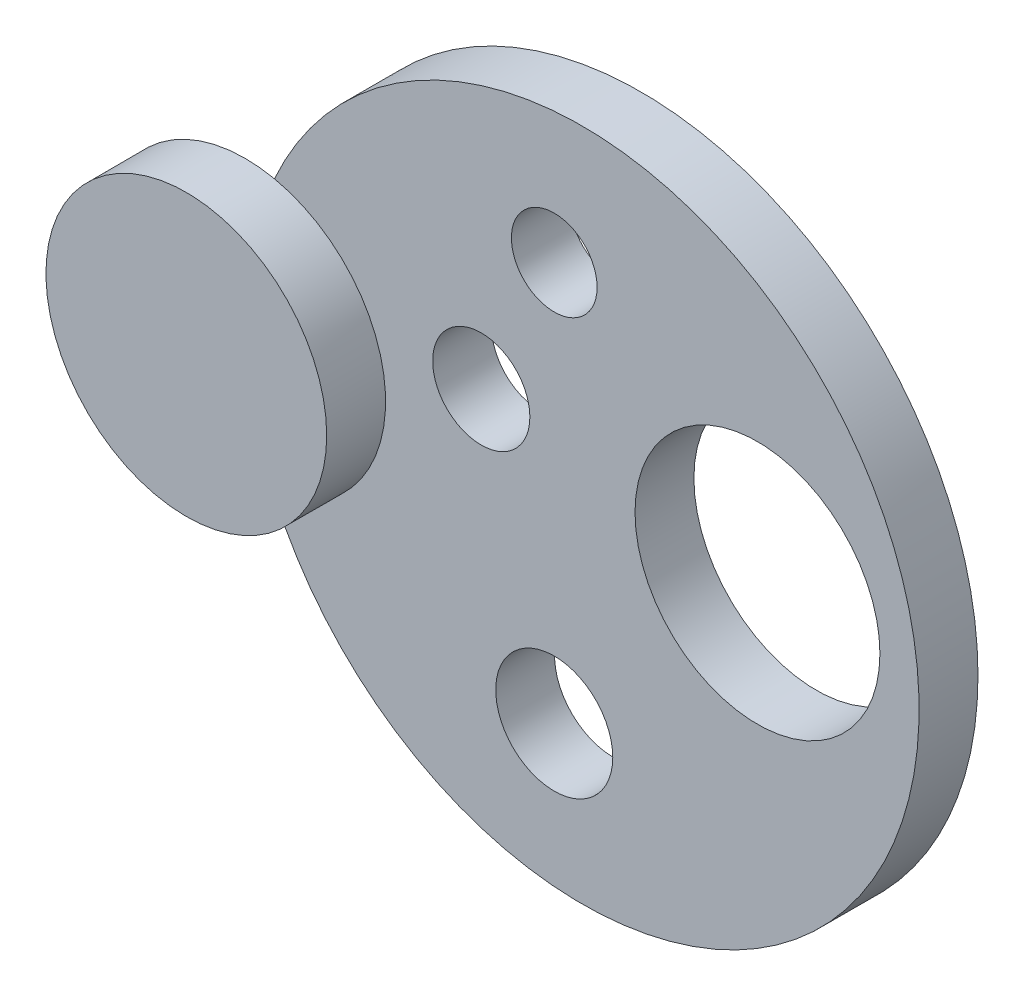
ISO-10303-21;
HEADER;
FILE_DESCRIPTION(('STEP AP214'),'2;1');
FILE_NAME('part.step','',(''),(''),'','','');
FILE_SCHEMA(('AUTOMOTIVE_DESIGN { 1 0 10303 214 1 1 1 1 }'));
ENDSEC;
DATA;
#1=APPLICATION_CONTEXT('core data for automotive mechanical design processes');
#2=APPLICATION_PROTOCOL_DEFINITION('international standard','automotive_design',2000,#1);
#3=PRODUCT_CONTEXT('',#1,'mechanical');
#4=PRODUCT('Part','Part','',(#3));
#5=PRODUCT_RELATED_PRODUCT_CATEGORY('part','',(#4));
#6=PRODUCT_DEFINITION_FORMATION('','',#4);
#7=PRODUCT_DEFINITION_CONTEXT('part definition',#1,'design');
#8=PRODUCT_DEFINITION('design','',#6,#7);
#9=PRODUCT_DEFINITION_SHAPE('','',#8);
#10=(LENGTH_UNIT() NAMED_UNIT(*) SI_UNIT(.MILLI.,.METRE.));
#11=(NAMED_UNIT(*) PLANE_ANGLE_UNIT() SI_UNIT($,.RADIAN.));
#12=(NAMED_UNIT(*) SI_UNIT($,.STERADIAN.) SOLID_ANGLE_UNIT());
#13=UNCERTAINTY_MEASURE_WITH_UNIT(LENGTH_MEASURE(1.E-05),#10,'distance_accuracy_value','');
#14=(GEOMETRIC_REPRESENTATION_CONTEXT(3) GLOBAL_UNCERTAINTY_ASSIGNED_CONTEXT((#13)) GLOBAL_UNIT_ASSIGNED_CONTEXT((#10,
#11,#12)) REPRESENTATION_CONTEXT('',''));
#15=CARTESIAN_POINT('',(0.,0.,0.));
#16=DIRECTION('',(0.,0.,1.));
#17=DIRECTION('',(1.,0.,0.));
#18=AXIS2_PLACEMENT_3D('',#15,#16,#17);
#19=CARTESIAN_POINT('',(0.,0.,10.));
#20=DIRECTION('',(0.,0.,1.));
#21=DIRECTION('',(1.,0.,0.));
#22=AXIS2_PLACEMENT_3D('',#19,#20,#21);
#23=PLANE('',#22);
#24=CARTESIAN_POINT('',(-17.1357797280188,9.96861022561217,10.));
#25=DIRECTION('',(0.,0.,1.));
#26=DIRECTION('',(1.,0.,0.));
#27=AXIS2_PLACEMENT_3D('',#24,#25,#26);
#28=CIRCLE('',#27,8.25458998638456);
#29=CARTESIAN_POINT('',(-8.88118974163421,9.96861022561217,10.));
#30=VERTEX_POINT('',#29);
#31=EDGE_CURVE('E79',#30,#30,#28,.T.);
#32=ORIENTED_EDGE('',*,*,#31,.F.);
#33=EDGE_LOOP('',(#32));
#34=FACE_BOUND('',#33,.T.);
#35=CARTESIAN_POINT('',(-57.2267029206175,0.,10.));
#36=DIRECTION('',(0.,0.,1.));
#37=DIRECTION('',(1.,0.,0.));
#38=AXIS2_PLACEMENT_3D('',#35,#36,#37);
#39=CIRCLE('',#38,23.8428595277048);
#40=CARTESIAN_POINT('',(-52.2597738346763,-23.3197677070998,10.));
#41=VERTEX_POINT('',#40);
#42=CARTESIAN_POINT('',(-52.2597738346763,23.3197677070998,10.));
#43=VERTEX_POINT('',#42);
#44=EDGE_CURVE('E11',#41,#43,#39,.T.);
#45=ORIENTED_EDGE('',*,*,#44,.F.);
#46=CARTESIAN_POINT('',(0.,0.,10.));
#47=DIRECTION('',(0.,0.,1.));
#48=DIRECTION('',(1.,0.,0.));
#49=AXIS2_PLACEMENT_3D('',#46,#47,#48);
#50=CIRCLE('',#49,57.2267029206175);
#51=EDGE_CURVE('E60',#41,#43,#50,.T.);
#52=ORIENTED_EDGE('',*,*,#51,.T.);
#53=EDGE_LOOP('',(#45,#52));
#54=FACE_BOUND('',#53,.T.);
#55=CARTESIAN_POINT('',(-4.74198966408268,-33.045918367347,10.));
#56=DIRECTION('',(0.,0.,1.));
#57=DIRECTION('',(1.,0.,0.));
#58=AXIS2_PLACEMENT_3D('',#55,#56,#57);
#59=CIRCLE('',#58,9.94018311761205);
#60=CARTESIAN_POINT('',(5.19819345352937,-33.045918367347,10.));
#61=VERTEX_POINT('',#60);
#62=EDGE_CURVE('E91',#61,#61,#59,.T.);
#63=ORIENTED_EDGE('',*,*,#62,.F.);
#64=EDGE_LOOP('',(#63));
#65=FACE_BOUND('',#64,.T.);
#66=CARTESIAN_POINT('',(-4.74198966408268,34.759410430839,10.));
#67=DIRECTION('',(0.,0.,1.));
#68=DIRECTION('',(1.,0.,0.));
#69=AXIS2_PLACEMENT_3D('',#66,#67,#68);
#70=CIRCLE('',#69,7.27796880395931);
#71=CARTESIAN_POINT('',(2.53597913987663,34.759410430839,10.));
#72=VERTEX_POINT('',#71);
#73=EDGE_CURVE('E99',#72,#72,#70,.T.);
#74=ORIENTED_EDGE('',*,*,#73,.F.);
#75=EDGE_LOOP('',(#74));
#76=FACE_BOUND('',#75,.T.);
#77=CARTESIAN_POINT('',(29.7726361862575,4.89569160997733,10.));
#78=DIRECTION('',(0.,0.,1.));
#79=DIRECTION('',(1.,0.,0.));
#80=AXIS2_PLACEMENT_3D('',#77,#78,#79);
#81=CIRCLE('',#80,20.7966075347722);
#82=CARTESIAN_POINT('',(50.5692437210297,4.89569160997733,10.));
#83=VERTEX_POINT('',#82);
#84=EDGE_CURVE('E83',#83,#83,#81,.T.);
#85=ORIENTED_EDGE('',*,*,#84,.F.);
#86=EDGE_LOOP('',(#85));
#87=FACE_BOUND('',#86,.T.);
#88=ADVANCED_FACE('F38',(#34,#54,#65,#76,#87),#23,.T.);
#89=CARTESIAN_POINT('',(0.,0.,0.));
#90=DIRECTION('',(0.,0.,1.));
#91=DIRECTION('',(1.,0.,0.));
#92=AXIS2_PLACEMENT_3D('',#89,#90,#91);
#93=PLANE('',#92);
#94=CARTESIAN_POINT('',(-17.1357797280188,9.96861022561217,0.));
#95=DIRECTION('',(0.,0.,1.));
#96=DIRECTION('',(1.,0.,0.));
#97=AXIS2_PLACEMENT_3D('',#94,#95,#96);
#98=CIRCLE('',#97,8.25458998638456);
#99=CARTESIAN_POINT('',(-8.88118974163421,9.96861022561217,0.));
#100=VERTEX_POINT('',#99);
#101=EDGE_CURVE('E72',#100,#100,#98,.T.);
#102=ORIENTED_EDGE('',*,*,#101,.T.);
#103=EDGE_LOOP('',(#102));
#104=FACE_BOUND('',#103,.T.);
#105=CARTESIAN_POINT('',(0.,0.,0.));
#106=DIRECTION('',(0.,0.,1.));
#107=DIRECTION('',(1.,0.,0.));
#108=AXIS2_PLACEMENT_3D('',#105,#106,#107);
#109=CIRCLE('',#108,57.2267029206175);
#110=CARTESIAN_POINT('',(57.2267029206175,0.,0.));
#111=VERTEX_POINT('',#110);
#112=EDGE_CURVE('E42',#111,#111,#109,.T.);
#113=ORIENTED_EDGE('',*,*,#112,.F.);
#114=EDGE_LOOP('',(#113));
#115=FACE_BOUND('',#114,.T.);
#116=CARTESIAN_POINT('',(-4.74198966408268,34.759410430839,0.));
#117=DIRECTION('',(0.,0.,1.));
#118=DIRECTION('',(1.,0.,0.));
#119=AXIS2_PLACEMENT_3D('',#116,#117,#118);
#120=CIRCLE('',#119,7.27796880395931);
#121=CARTESIAN_POINT('',(2.53597913987663,34.759410430839,0.));
#122=VERTEX_POINT('',#121);
#123=EDGE_CURVE('E95',#122,#122,#120,.T.);
#124=ORIENTED_EDGE('',*,*,#123,.T.);
#125=EDGE_LOOP('',(#124));
#126=FACE_BOUND('',#125,.T.);
#127=CARTESIAN_POINT('',(-4.74198966408268,-33.045918367347,0.));
#128=DIRECTION('',(0.,0.,1.));
#129=DIRECTION('',(1.,0.,0.));
#130=AXIS2_PLACEMENT_3D('',#127,#128,#129);
#131=CIRCLE('',#130,9.94018311761205);
#132=CARTESIAN_POINT('',(5.19819345352937,-33.045918367347,0.));
#133=VERTEX_POINT('',#132);
#134=EDGE_CURVE('E87',#133,#133,#131,.T.);
#135=ORIENTED_EDGE('',*,*,#134,.T.);
#136=EDGE_LOOP('',(#135));
#137=FACE_BOUND('',#136,.T.);
#138=CARTESIAN_POINT('',(29.7726361862575,4.89569160997733,0.));
#139=DIRECTION('',(0.,0.,1.));
#140=DIRECTION('',(1.,0.,0.));
#141=AXIS2_PLACEMENT_3D('',#138,#139,#140);
#142=CIRCLE('',#141,20.7966075347722);
#143=CARTESIAN_POINT('',(50.5692437210297,4.89569160997733,0.));
#144=VERTEX_POINT('',#143);
#145=EDGE_CURVE('E76',#144,#144,#142,.T.);
#146=ORIENTED_EDGE('',*,*,#145,.T.);
#147=EDGE_LOOP('',(#146));
#148=FACE_BOUND('',#147,.T.);
#149=ADVANCED_FACE('F107',(#104,#115,#126,#137,#148),#93,.F.);
#150=CARTESIAN_POINT('',(0.,0.,10.));
#151=DIRECTION('',(0.,0.,-1.));
#152=DIRECTION('',(-1.,0.,0.));
#153=AXIS2_PLACEMENT_3D('',#150,#151,#152);
#154=CYLINDRICAL_SURFACE('',#153,57.2267029206175);
#155=EDGE_CURVE('E48',#43,#41,#50,.T.);
#156=ORIENTED_EDGE('',*,*,#155,.F.);
#157=ORIENTED_EDGE('',*,*,#51,.F.);
#158=EDGE_LOOP('',(#156,#157));
#159=FACE_BOUND('',#158,.T.);
#160=ORIENTED_EDGE('',*,*,#112,.T.);
#161=EDGE_LOOP('',(#160));
#162=FACE_BOUND('',#161,.T.);
#163=ADVANCED_FACE('F40',(#159,#162),#154,.T.);
#164=CARTESIAN_POINT('',(-4.74198966408268,34.759410430839,10.));
#165=DIRECTION('',(0.,0.,-1.));
#166=DIRECTION('',(-1.,0.,0.));
#167=AXIS2_PLACEMENT_3D('',#164,#165,#166);
#168=CYLINDRICAL_SURFACE('',#167,7.27796880395931);
#169=ORIENTED_EDGE('',*,*,#73,.T.);
#170=EDGE_LOOP('',(#169));
#171=FACE_BOUND('',#170,.T.);
#172=ORIENTED_EDGE('',*,*,#123,.F.);
#173=EDGE_LOOP('',(#172));
#174=FACE_BOUND('',#173,.T.);
#175=ADVANCED_FACE('F110',(#171,#174),#168,.F.);
#176=CARTESIAN_POINT('',(-4.74198966408268,-33.045918367347,10.));
#177=DIRECTION('',(0.,0.,-1.));
#178=DIRECTION('',(-1.,0.,0.));
#179=AXIS2_PLACEMENT_3D('',#176,#177,#178);
#180=CYLINDRICAL_SURFACE('',#179,9.94018311761205);
#181=ORIENTED_EDGE('',*,*,#62,.T.);
#182=EDGE_LOOP('',(#181));
#183=FACE_BOUND('',#182,.T.);
#184=ORIENTED_EDGE('',*,*,#134,.F.);
#185=EDGE_LOOP('',(#184));
#186=FACE_BOUND('',#185,.T.);
#187=ADVANCED_FACE('F112',(#183,#186),#180,.F.);
#188=CARTESIAN_POINT('',(29.7726361862575,4.89569160997733,10.));
#189=DIRECTION('',(0.,0.,-1.));
#190=DIRECTION('',(-1.,0.,0.));
#191=AXIS2_PLACEMENT_3D('',#188,#189,#190);
#192=CYLINDRICAL_SURFACE('',#191,20.7966075347722);
#193=ORIENTED_EDGE('',*,*,#84,.T.);
#194=EDGE_LOOP('',(#193));
#195=FACE_BOUND('',#194,.T.);
#196=ORIENTED_EDGE('',*,*,#145,.F.);
#197=EDGE_LOOP('',(#196));
#198=FACE_BOUND('',#197,.T.);
#199=ADVANCED_FACE('F119',(#195,#198),#192,.F.);
#200=CARTESIAN_POINT('',(-57.2267029206175,0.,10.));
#201=DIRECTION('',(0.,0.,1.));
#202=DIRECTION('',(1.,0.,0.));
#203=AXIS2_PLACEMENT_3D('',#200,#201,#202);
#204=PLANE('',#203);
#205=EDGE_CURVE('E50',#43,#41,#39,.T.);
#206=ORIENTED_EDGE('',*,*,#205,.F.);
#207=ORIENTED_EDGE('',*,*,#155,.T.);
#208=EDGE_LOOP('',(#206,#207));
#209=FACE_BOUND('',#208,.T.);
#210=ADVANCED_FACE('F69',(#209),#204,.F.);
#211=CARTESIAN_POINT('',(-57.2267029206175,0.,20.));
#212=DIRECTION('',(0.,0.,-1.));
#213=DIRECTION('',(-1.,0.,0.));
#214=AXIS2_PLACEMENT_3D('',#211,#212,#213);
#215=CYLINDRICAL_SURFACE('',#214,23.8428595277048);
#216=CARTESIAN_POINT('',(-57.2267029206175,0.,20.));
#217=DIRECTION('',(0.,0.,1.));
#218=DIRECTION('',(1.,0.,0.));
#219=AXIS2_PLACEMENT_3D('',#216,#217,#218);
#220=CIRCLE('',#219,23.8428595277048);
#221=CARTESIAN_POINT('',(-33.3838433929127,0.,20.));
#222=VERTEX_POINT('',#221);
#223=EDGE_CURVE('E71',#222,#222,#220,.T.);
#224=ORIENTED_EDGE('',*,*,#223,.F.);
#225=EDGE_LOOP('',(#224));
#226=FACE_BOUND('',#225,.T.);
#227=ORIENTED_EDGE('',*,*,#205,.T.);
#228=ORIENTED_EDGE('',*,*,#44,.T.);
#229=EDGE_LOOP('',(#227,#228));
#230=FACE_BOUND('',#229,.T.);
#231=ADVANCED_FACE('F68',(#226,#230),#215,.T.);
#232=CARTESIAN_POINT('',(-57.2267029206175,0.,20.));
#233=DIRECTION('',(0.,0.,1.));
#234=DIRECTION('',(1.,0.,0.));
#235=AXIS2_PLACEMENT_3D('',#232,#233,#234);
#236=PLANE('',#235);
#237=ORIENTED_EDGE('',*,*,#223,.T.);
#238=EDGE_LOOP('',(#237));
#239=FACE_BOUND('',#238,.T.);
#240=ADVANCED_FACE('F137',(#239),#236,.T.);
#241=CARTESIAN_POINT('',(-17.1357797280188,9.96861022561217,0.));
#242=DIRECTION('',(0.,0.,1.));
#243=DIRECTION('',(1.,0.,0.));
#244=AXIS2_PLACEMENT_3D('',#241,#242,#243);
#245=CYLINDRICAL_SURFACE('',#244,8.25458998638456);
#246=ORIENTED_EDGE('',*,*,#101,.F.);
#247=EDGE_LOOP('',(#246));
#248=FACE_BOUND('',#247,.T.);
#249=ORIENTED_EDGE('',*,*,#31,.T.);
#250=EDGE_LOOP('',(#249));
#251=FACE_BOUND('',#250,.T.);
#252=ADVANCED_FACE('F135',(#248,#251),#245,.F.);
#253=CLOSED_SHELL('',(#88,#149,#163,#175,#187,#199,#210,#231,#240,#252));
#254=MANIFOLD_SOLID_BREP('B2',#253);
#255=ADVANCED_BREP_SHAPE_REPRESENTATION('',(#18,#254),#14);
#256=SHAPE_DEFINITION_REPRESENTATION(#9,#255);
ENDSEC;
END-ISO-10303-21;
